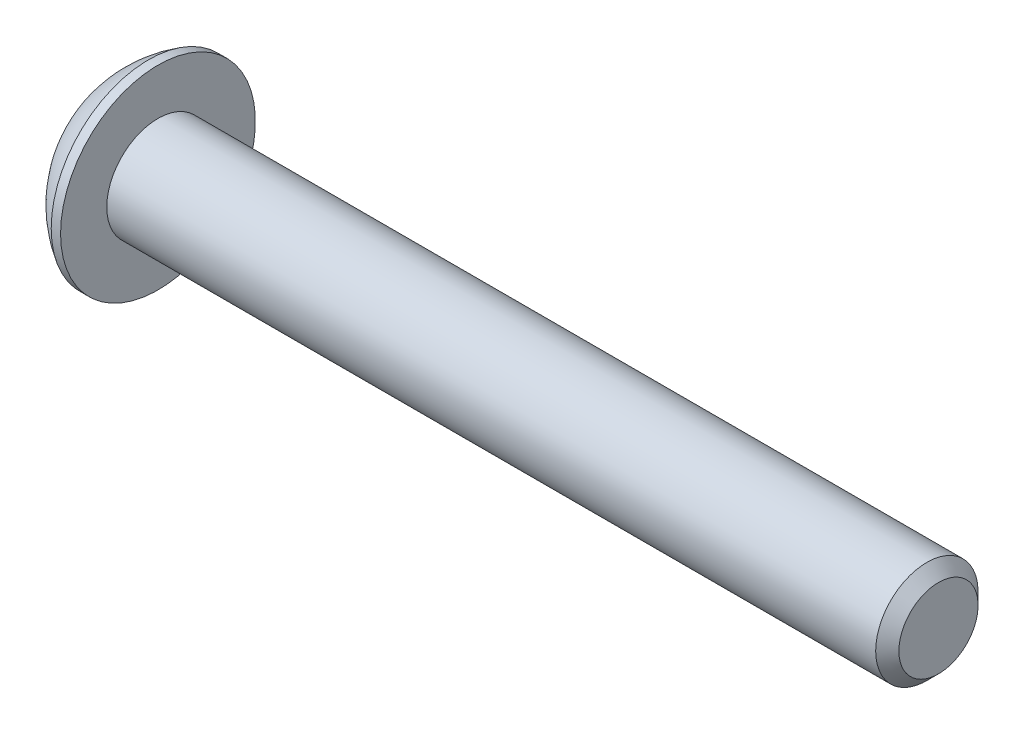
ISO-10303-21;
HEADER;
FILE_DESCRIPTION(('STEP AP214'),'2;1');
FILE_NAME('part.step','',(''),(''),'','','');
FILE_SCHEMA(('AUTOMOTIVE_DESIGN { 1 0 10303 214 1 1 1 1 }'));
ENDSEC;
DATA;
#1=APPLICATION_CONTEXT('core data for automotive mechanical design processes');
#2=APPLICATION_PROTOCOL_DEFINITION('international standard','automotive_design',2000,#1);
#3=PRODUCT_CONTEXT('',#1,'mechanical');
#4=PRODUCT('Part','Part','',(#3));
#5=PRODUCT_RELATED_PRODUCT_CATEGORY('part','',(#4));
#6=PRODUCT_DEFINITION_FORMATION('','',#4);
#7=PRODUCT_DEFINITION_CONTEXT('part definition',#1,'design');
#8=PRODUCT_DEFINITION('design','',#6,#7);
#9=PRODUCT_DEFINITION_SHAPE('','',#8);
#10=(LENGTH_UNIT() NAMED_UNIT(*) SI_UNIT(.MILLI.,.METRE.));
#11=(NAMED_UNIT(*) PLANE_ANGLE_UNIT() SI_UNIT($,.RADIAN.));
#12=(NAMED_UNIT(*) SI_UNIT($,.STERADIAN.) SOLID_ANGLE_UNIT());
#13=UNCERTAINTY_MEASURE_WITH_UNIT(LENGTH_MEASURE(1.E-05),#10,'distance_accuracy_value','');
#14=(GEOMETRIC_REPRESENTATION_CONTEXT(3) GLOBAL_UNCERTAINTY_ASSIGNED_CONTEXT((#13)) GLOBAL_UNIT_ASSIGNED_CONTEXT((#10,
#11,#12)) REPRESENTATION_CONTEXT('',''));
#15=CARTESIAN_POINT('',(0.,0.,0.));
#16=DIRECTION('',(0.,0.,1.));
#17=DIRECTION('',(1.,0.,0.));
#18=AXIS2_PLACEMENT_3D('',#15,#16,#17);
#19=CARTESIAN_POINT('',(1.32079999997359,0.,0.));
#20=DIRECTION('',(-1.,0.,0.));
#21=DIRECTION('',(0.,0.,1.));
#22=AXIS2_PLACEMENT_3D('',#19,#20,#21);
#23=CONICAL_SURFACE('',#22,1.19380000001001,1.04719755119008);
#24=CARTESIAN_POINT('',(2.0100407513155,0.,0.));
#25=VERTEX_POINT('',#24);
#26=VERTEX_LOOP('',#25);
#27=FACE_BOUND('',#26,.T.);
#28=CARTESIAN_POINT('',(1.32079999997359,0.,0.));
#29=DIRECTION('',(-1.,0.,0.));
#30=DIRECTION('',(0.,0.,1.));
#31=AXIS2_PLACEMENT_3D('',#28,#29,#30);
#32=CIRCLE('',#31,1.19380000001001);
#33=CARTESIAN_POINT('',(1.32079999998682,-1.0338611270422,0.596900000002503));
#34=VERTEX_POINT('',#33);
#35=CARTESIAN_POINT('',(1.32079999998682,0.,1.19380000000501));
#36=VERTEX_POINT('',#35);
#37=EDGE_CURVE('E92',#34,#36,#32,.T.);
#38=ORIENTED_EDGE('',*,*,#37,.T.);
#39=CARTESIAN_POINT('',(1.32079999997359,0.,0.));
#40=DIRECTION('',(-1.,0.,0.));
#41=DIRECTION('',(0.,0.,1.));
#42=AXIS2_PLACEMENT_3D('',#39,#40,#41);
#43=CIRCLE('',#42,1.19380000001001);
#44=CARTESIAN_POINT('',(1.32079999998682,1.0338611270422,0.596900000002504));
#45=VERTEX_POINT('',#44);
#46=EDGE_CURVE('E88',#36,#45,#43,.T.);
#47=ORIENTED_EDGE('',*,*,#46,.T.);
#48=CARTESIAN_POINT('',(1.32079999997359,0.,0.));
#49=DIRECTION('',(-1.,0.,0.));
#50=DIRECTION('',(0.,0.,1.));
#51=AXIS2_PLACEMENT_3D('',#48,#49,#50);
#52=CIRCLE('',#51,1.19380000001001);
#53=CARTESIAN_POINT('',(1.32079999998682,1.0338611270422,-0.596900000002504));
#54=VERTEX_POINT('',#53);
#55=EDGE_CURVE('E21',#45,#54,#52,.T.);
#56=ORIENTED_EDGE('',*,*,#55,.T.);
#57=CARTESIAN_POINT('',(1.32079999997359,0.,0.));
#58=DIRECTION('',(-1.,0.,0.));
#59=DIRECTION('',(0.,0.,1.));
#60=AXIS2_PLACEMENT_3D('',#57,#58,#59);
#61=CIRCLE('',#60,1.19380000001001);
#62=CARTESIAN_POINT('',(1.32079999998682,1.49461108489558E-12,-1.19380000000501));
#63=VERTEX_POINT('',#62);
#64=EDGE_CURVE('E151',#54,#63,#61,.T.);
#65=ORIENTED_EDGE('',*,*,#64,.T.);
#66=CARTESIAN_POINT('',(1.32079999997359,0.,0.));
#67=DIRECTION('',(-1.,0.,0.));
#68=DIRECTION('',(0.,0.,1.));
#69=AXIS2_PLACEMENT_3D('',#66,#67,#68);
#70=CIRCLE('',#69,1.19380000001001);
#71=CARTESIAN_POINT('',(1.32079999998682,-1.0338611270422,-0.596900000002503));
#72=VERTEX_POINT('',#71);
#73=EDGE_CURVE('E153',#63,#72,#70,.T.);
#74=ORIENTED_EDGE('',*,*,#73,.T.);
#75=CARTESIAN_POINT('',(1.32079999997359,0.,0.));
#76=DIRECTION('',(-1.,0.,0.));
#77=DIRECTION('',(0.,0.,1.));
#78=AXIS2_PLACEMENT_3D('',#75,#76,#77);
#79=CIRCLE('',#78,1.19380000001001);
#80=EDGE_CURVE('E155',#72,#34,#79,.T.);
#81=ORIENTED_EDGE('',*,*,#80,.T.);
#82=EDGE_LOOP('',(#38,#47,#56,#65,#74,#81));
#83=FACE_BOUND('',#82,.T.);
#84=ADVANCED_FACE('F17',(#27,#83),#23,.F.);
#85=CARTESIAN_POINT('',(1.3208,-2.06772225407572,-1.1938));
#86=DIRECTION('',(1.,0.,0.));
#87=DIRECTION('',(0.,0.,-1.));
#88=AXIS2_PLACEMENT_3D('',#85,#86,#87);
#89=PLANE('',#88);
#90=DIRECTION('',(0.,-0.5,-0.866025403784439));
#91=VECTOR('',#90,1.);
#92=CARTESIAN_POINT('',(1.32080000000004,1.37848150271715,0.));
#93=LINE('',#92,#91);
#94=CARTESIAN_POINT('',(1.32080000000001,1.37848150271715,0.));
#95=VERTEX_POINT('',#94);
#96=EDGE_CURVE('E104',#54,#95,#93,.F.);
#97=ORIENTED_EDGE('',*,*,#96,.F.);
#98=ORIENTED_EDGE('',*,*,#55,.F.);
#99=DIRECTION('',(0.,0.5,-0.866025403784439));
#100=VECTOR('',#99,1.);
#101=CARTESIAN_POINT('',(1.3208,0.689240751358576,1.1938));
#102=LINE('',#101,#100);
#103=EDGE_CURVE('E102',#95,#45,#102,.F.);
#104=ORIENTED_EDGE('',*,*,#103,.F.);
#105=EDGE_LOOP('',(#97,#98,#104));
#106=FACE_BOUND('',#105,.T.);
#107=ADVANCED_FACE('F100',(#106),#89,.F.);
#108=CARTESIAN_POINT('',(1.3208,-2.06772225407572,-1.1938));
#109=DIRECTION('',(1.,0.,0.));
#110=DIRECTION('',(0.,0.,-1.));
#111=AXIS2_PLACEMENT_3D('',#108,#109,#110);
#112=PLANE('',#111);
#113=DIRECTION('',(0.,0.5,-0.866025403784439));
#114=VECTOR('',#113,1.);
#115=CARTESIAN_POINT('',(1.32080000000004,0.689240751358576,1.1938));
#116=LINE('',#115,#114);
#117=CARTESIAN_POINT('',(1.32080000000001,0.689240751358576,1.1938));
#118=VERTEX_POINT('',#117);
#119=EDGE_CURVE('E106',#45,#118,#116,.F.);
#120=ORIENTED_EDGE('',*,*,#119,.F.);
#121=ORIENTED_EDGE('',*,*,#46,.F.);
#122=DIRECTION('',(0.,1.,0.));
#123=VECTOR('',#122,1.);
#124=CARTESIAN_POINT('',(1.3208,-0.689240751358574,1.1938));
#125=LINE('',#124,#123);
#126=EDGE_CURVE('E109',#118,#36,#125,.F.);
#127=ORIENTED_EDGE('',*,*,#126,.F.);
#128=EDGE_LOOP('',(#120,#121,#127));
#129=FACE_BOUND('',#128,.T.);
#130=ADVANCED_FACE('F107',(#129),#112,.F.);
#131=CARTESIAN_POINT('',(1.3208,-2.06772225407572,-1.1938));
#132=DIRECTION('',(1.,0.,0.));
#133=DIRECTION('',(0.,0.,-1.));
#134=AXIS2_PLACEMENT_3D('',#131,#132,#133);
#135=PLANE('',#134);
#136=DIRECTION('',(0.,1.,0.));
#137=VECTOR('',#136,1.);
#138=CARTESIAN_POINT('',(1.32080000000004,-0.689240751358574,1.1938));
#139=LINE('',#138,#137);
#140=CARTESIAN_POINT('',(1.32080000000001,-0.689240751358574,1.1938));
#141=VERTEX_POINT('',#140);
#142=EDGE_CURVE('E169',#36,#141,#139,.F.);
#143=ORIENTED_EDGE('',*,*,#142,.F.);
#144=ORIENTED_EDGE('',*,*,#37,.F.);
#145=DIRECTION('',(0.,0.5,0.866025403784439));
#146=VECTOR('',#145,1.);
#147=CARTESIAN_POINT('',(1.3208,-1.37848150271715,0.));
#148=LINE('',#147,#146);
#149=EDGE_CURVE('E167',#141,#34,#148,.F.);
#150=ORIENTED_EDGE('',*,*,#149,.F.);
#151=EDGE_LOOP('',(#143,#144,#150));
#152=FACE_BOUND('',#151,.T.);
#153=ADVANCED_FACE('F165',(#152),#135,.F.);
#154=CARTESIAN_POINT('',(1.3208,-2.06772225407572,-1.1938));
#155=DIRECTION('',(1.,0.,0.));
#156=DIRECTION('',(0.,0.,-1.));
#157=AXIS2_PLACEMENT_3D('',#154,#155,#156);
#158=PLANE('',#157);
#159=DIRECTION('',(0.,0.5,0.866025403784439));
#160=VECTOR('',#159,1.);
#161=CARTESIAN_POINT('',(1.32080000000004,-1.37848150271715,0.));
#162=LINE('',#161,#160);
#163=CARTESIAN_POINT('',(1.32080000000001,-1.37848150271715,0.));
#164=VERTEX_POINT('',#163);
#165=EDGE_CURVE('E170',#34,#164,#162,.F.);
#166=ORIENTED_EDGE('',*,*,#165,.F.);
#167=ORIENTED_EDGE('',*,*,#80,.F.);
#168=DIRECTION('',(0.,-0.5,0.866025403784439));
#169=VECTOR('',#168,1.);
#170=CARTESIAN_POINT('',(1.3208,-0.689240751358574,-1.1938));
#171=LINE('',#170,#169);
#172=EDGE_CURVE('E173',#164,#72,#171,.F.);
#173=ORIENTED_EDGE('',*,*,#172,.F.);
#174=EDGE_LOOP('',(#166,#167,#173));
#175=FACE_BOUND('',#174,.T.);
#176=ADVANCED_FACE('F171',(#175),#158,.F.);
#177=CARTESIAN_POINT('',(1.3208,-2.06772225407572,-1.1938));
#178=DIRECTION('',(1.,0.,0.));
#179=DIRECTION('',(0.,0.,-1.));
#180=AXIS2_PLACEMENT_3D('',#177,#178,#179);
#181=PLANE('',#180);
#182=DIRECTION('',(0.,-0.5,0.866025403784439));
#183=VECTOR('',#182,1.);
#184=CARTESIAN_POINT('',(1.32080000000004,-0.689240751358574,-1.1938));
#185=LINE('',#184,#183);
#186=CARTESIAN_POINT('',(1.32080000000001,-0.689240751358574,-1.1938));
#187=VERTEX_POINT('',#186);
#188=EDGE_CURVE('E228',#72,#187,#185,.F.);
#189=ORIENTED_EDGE('',*,*,#188,.F.);
#190=ORIENTED_EDGE('',*,*,#73,.F.);
#191=DIRECTION('',(0.,1.,0.));
#192=VECTOR('',#191,1.);
#193=CARTESIAN_POINT('',(1.3208,0.689240751358577,-1.1938));
#194=LINE('',#193,#192);
#195=EDGE_CURVE('E240',#187,#63,#194,.T.);
#196=ORIENTED_EDGE('',*,*,#195,.F.);
#197=EDGE_LOOP('',(#189,#190,#196));
#198=FACE_BOUND('',#197,.T.);
#199=ADVANCED_FACE('F369',(#198),#181,.F.);
#200=CARTESIAN_POINT('',(1.3208,-2.06772225407572,-1.1938));
#201=DIRECTION('',(1.,0.,0.));
#202=DIRECTION('',(0.,0.,-1.));
#203=AXIS2_PLACEMENT_3D('',#200,#201,#202);
#204=PLANE('',#203);
#205=DIRECTION('',(0.,1.,0.));
#206=VECTOR('',#205,1.);
#207=CARTESIAN_POINT('',(1.32080000000004,0.689240751358577,-1.1938));
#208=LINE('',#207,#206);
#209=CARTESIAN_POINT('',(1.32080000000002,0.689240751358565,-1.19380000000002));
#210=VERTEX_POINT('',#209);
#211=EDGE_CURVE('E248',#63,#210,#208,.T.);
#212=ORIENTED_EDGE('',*,*,#211,.F.);
#213=ORIENTED_EDGE('',*,*,#64,.F.);
#214=DIRECTION('',(0.,-0.5,-0.866025403784439));
#215=VECTOR('',#214,1.);
#216=CARTESIAN_POINT('',(1.3208,1.37848150271715,0.));
#217=LINE('',#216,#215);
#218=EDGE_CURVE('E128',#210,#54,#217,.F.);
#219=ORIENTED_EDGE('',*,*,#218,.F.);
#220=EDGE_LOOP('',(#212,#213,#219));
#221=FACE_BOUND('',#220,.T.);
#222=ADVANCED_FACE('F361',(#221),#204,.F.);
#223=CARTESIAN_POINT('',(1.3208,1.37848150271715,0.));
#224=DIRECTION('',(0.,-0.866025403784439,0.5));
#225=DIRECTION('',(0.,-0.5,-0.866025403784439));
#226=AXIS2_PLACEMENT_3D('',#223,#224,#225);
#227=PLANE('',#226);
#228=ORIENTED_EDGE('',*,*,#96,.T.);
#229=DIRECTION('',(1.,0.,0.));
#230=VECTOR('',#229,1.);
#231=CARTESIAN_POINT('',(1.3208,1.37848150271715,0.));
#232=LINE('',#231,#230);
#233=CARTESIAN_POINT('',(0.,1.37848150271715,0.));
#234=VERTEX_POINT('',#233);
#235=EDGE_CURVE('E116',#234,#95,#232,.T.);
#236=ORIENTED_EDGE('',*,*,#235,.F.);
#237=DIRECTION('',(0.,0.5,0.866025403784439));
#238=VECTOR('',#237,1.);
#239=CARTESIAN_POINT('',(0.,0.689240751358577,-1.1938));
#240=LINE('',#239,#238);
#241=CARTESIAN_POINT('',(0.,0.689240751358577,-1.1938));
#242=VERTEX_POINT('',#241);
#243=EDGE_CURVE('E131',#242,#234,#240,.T.);
#244=ORIENTED_EDGE('',*,*,#243,.F.);
#245=DIRECTION('',(1.,0.,0.));
#246=VECTOR('',#245,1.);
#247=CARTESIAN_POINT('',(1.3208,0.689240751358577,-1.1938));
#248=LINE('',#247,#246);
#249=EDGE_CURVE('E135',#210,#242,#248,.F.);
#250=ORIENTED_EDGE('',*,*,#249,.F.);
#251=ORIENTED_EDGE('',*,*,#218,.T.);
#252=EDGE_LOOP('',(#228,#236,#244,#250,#251));
#253=FACE_BOUND('',#252,.T.);
#254=ADVANCED_FACE('F354',(#253),#227,.T.);
#255=CARTESIAN_POINT('',(1.3208,0.689240751358576,1.1938));
#256=DIRECTION('',(0.,-0.866025403784439,-0.5));
#257=DIRECTION('',(0.,0.5,-0.866025403784439));
#258=AXIS2_PLACEMENT_3D('',#255,#256,#257);
#259=PLANE('',#258);
#260=ORIENTED_EDGE('',*,*,#119,.T.);
#261=DIRECTION('',(1.,0.,0.));
#262=VECTOR('',#261,1.);
#263=CARTESIAN_POINT('',(1.3208,0.689240751358576,1.1938));
#264=LINE('',#263,#262);
#265=CARTESIAN_POINT('',(0.,0.689240751358577,1.1938));
#266=VERTEX_POINT('',#265);
#267=EDGE_CURVE('E112',#266,#118,#264,.T.);
#268=ORIENTED_EDGE('',*,*,#267,.F.);
#269=DIRECTION('',(0.,-0.5,0.866025403784439));
#270=VECTOR('',#269,1.);
#271=CARTESIAN_POINT('',(0.,1.37848150271715,0.));
#272=LINE('',#271,#270);
#273=EDGE_CURVE('E134',#234,#266,#272,.T.);
#274=ORIENTED_EDGE('',*,*,#273,.F.);
#275=ORIENTED_EDGE('',*,*,#235,.T.);
#276=ORIENTED_EDGE('',*,*,#103,.T.);
#277=EDGE_LOOP('',(#260,#268,#274,#275,#276));
#278=FACE_BOUND('',#277,.T.);
#279=ADVANCED_FACE('F114',(#278),#259,.T.);
#280=CARTESIAN_POINT('',(1.3208,-0.689240751358574,1.1938));
#281=DIRECTION('',(0.,0.,-1.));
#282=DIRECTION('',(0.,1.,0.));
#283=AXIS2_PLACEMENT_3D('',#280,#281,#282);
#284=PLANE('',#283);
#285=ORIENTED_EDGE('',*,*,#142,.T.);
#286=DIRECTION('',(1.,0.,0.));
#287=VECTOR('',#286,1.);
#288=CARTESIAN_POINT('',(1.3208,-0.689240751358574,1.1938));
#289=LINE('',#288,#287);
#290=CARTESIAN_POINT('',(0.,-0.689240751358574,1.1938));
#291=VERTEX_POINT('',#290);
#292=EDGE_CURVE('E180',#291,#141,#289,.T.);
#293=ORIENTED_EDGE('',*,*,#292,.F.);
#294=DIRECTION('',(0.,1.,0.));
#295=VECTOR('',#294,1.);
#296=CARTESIAN_POINT('',(0.,0.,1.1938));
#297=LINE('',#296,#295);
#298=EDGE_CURVE('E194',#266,#291,#297,.F.);
#299=ORIENTED_EDGE('',*,*,#298,.F.);
#300=ORIENTED_EDGE('',*,*,#267,.T.);
#301=ORIENTED_EDGE('',*,*,#126,.T.);
#302=EDGE_LOOP('',(#285,#293,#299,#300,#301));
#303=FACE_BOUND('',#302,.T.);
#304=ADVANCED_FACE('F216',(#303),#284,.T.);
#305=CARTESIAN_POINT('',(1.3208,-1.37848150271715,0.));
#306=DIRECTION('',(0.,0.866025403784439,-0.5));
#307=DIRECTION('',(0.,0.5,0.866025403784439));
#308=AXIS2_PLACEMENT_3D('',#305,#306,#307);
#309=PLANE('',#308);
#310=ORIENTED_EDGE('',*,*,#165,.T.);
#311=DIRECTION('',(1.,0.,0.));
#312=VECTOR('',#311,1.);
#313=CARTESIAN_POINT('',(1.3208,-1.37848150271715,0.));
#314=LINE('',#313,#312);
#315=CARTESIAN_POINT('',(0.,-1.37848150271715,0.));
#316=VERTEX_POINT('',#315);
#317=EDGE_CURVE('E176',#316,#164,#314,.T.);
#318=ORIENTED_EDGE('',*,*,#317,.F.);
#319=DIRECTION('',(0.,-0.5,-0.866025403784439));
#320=VECTOR('',#319,1.);
#321=CARTESIAN_POINT('',(0.,-0.689240751358574,1.1938));
#322=LINE('',#321,#320);
#323=EDGE_CURVE('E197',#291,#316,#322,.T.);
#324=ORIENTED_EDGE('',*,*,#323,.F.);
#325=ORIENTED_EDGE('',*,*,#292,.T.);
#326=ORIENTED_EDGE('',*,*,#149,.T.);
#327=EDGE_LOOP('',(#310,#318,#324,#325,#326));
#328=FACE_BOUND('',#327,.T.);
#329=ADVANCED_FACE('F178',(#328),#309,.T.);
#330=CARTESIAN_POINT('',(1.3208,-0.689240751358574,-1.1938));
#331=DIRECTION('',(0.,0.866025403784439,0.5));
#332=DIRECTION('',(0.,-0.5,0.866025403784439));
#333=AXIS2_PLACEMENT_3D('',#330,#331,#332);
#334=PLANE('',#333);
#335=ORIENTED_EDGE('',*,*,#188,.T.);
#336=DIRECTION('',(1.,0.,0.));
#337=VECTOR('',#336,1.);
#338=CARTESIAN_POINT('',(1.3208,-0.689240751358574,-1.1938));
#339=LINE('',#338,#337);
#340=CARTESIAN_POINT('',(0.,-0.689240751358574,-1.1938));
#341=VERTEX_POINT('',#340);
#342=EDGE_CURVE('E36',#341,#187,#339,.T.);
#343=ORIENTED_EDGE('',*,*,#342,.F.);
#344=DIRECTION('',(0.,0.5,-0.866025403784439));
#345=VECTOR('',#344,1.);
#346=CARTESIAN_POINT('',(0.,-1.37848150271715,0.));
#347=LINE('',#346,#345);
#348=EDGE_CURVE('E217',#316,#341,#347,.T.);
#349=ORIENTED_EDGE('',*,*,#348,.F.);
#350=ORIENTED_EDGE('',*,*,#317,.T.);
#351=ORIENTED_EDGE('',*,*,#172,.T.);
#352=EDGE_LOOP('',(#335,#343,#349,#350,#351));
#353=FACE_BOUND('',#352,.T.);
#354=ADVANCED_FACE('F328',(#353),#334,.T.);
#355=CARTESIAN_POINT('',(1.3208,0.689240751358577,-1.1938));
#356=DIRECTION('',(0.,0.,1.));
#357=DIRECTION('',(1.,0.,0.));
#358=AXIS2_PLACEMENT_3D('',#355,#356,#357);
#359=PLANE('',#358);
#360=ORIENTED_EDGE('',*,*,#211,.T.);
#361=ORIENTED_EDGE('',*,*,#249,.T.);
#362=DIRECTION('',(0.,1.,0.));
#363=VECTOR('',#362,1.);
#364=CARTESIAN_POINT('',(0.,0.,-1.1938));
#365=LINE('',#364,#363);
#366=EDGE_CURVE('E150',#341,#242,#365,.T.);
#367=ORIENTED_EDGE('',*,*,#366,.F.);
#368=ORIENTED_EDGE('',*,*,#342,.T.);
#369=ORIENTED_EDGE('',*,*,#195,.T.);
#370=EDGE_LOOP('',(#360,#361,#367,#368,#369));
#371=FACE_BOUND('',#370,.T.);
#372=ADVANCED_FACE('F321',(#371),#359,.T.);
#373=CARTESIAN_POINT('',(0.,0.,0.));
#374=DIRECTION('',(-1.,0.,0.));
#375=DIRECTION('',(0.,0.,1.));
#376=AXIS2_PLACEMENT_3D('',#373,#374,#375);
#377=PLANE('',#376);
#378=CARTESIAN_POINT('',(0.,0.,0.));
#379=DIRECTION('',(-1.,0.,0.));
#380=DIRECTION('',(0.,0.,1.));
#381=AXIS2_PLACEMENT_3D('',#378,#379,#380);
#382=CIRCLE('',#381,1.9812);
#383=CARTESIAN_POINT('',(0.,0.,1.9812));
#384=VERTEX_POINT('',#383);
#385=EDGE_CURVE('E147',#384,#384,#382,.F.);
#386=ORIENTED_EDGE('',*,*,#385,.F.);
#387=EDGE_LOOP('',(#386));
#388=FACE_BOUND('',#387,.T.);
#389=ORIENTED_EDGE('',*,*,#348,.T.);
#390=ORIENTED_EDGE('',*,*,#366,.T.);
#391=ORIENTED_EDGE('',*,*,#243,.T.);
#392=ORIENTED_EDGE('',*,*,#273,.T.);
#393=ORIENTED_EDGE('',*,*,#298,.T.);
#394=ORIENTED_EDGE('',*,*,#323,.T.);
#395=EDGE_LOOP('',(#389,#390,#391,#392,#393,#394));
#396=FACE_BOUND('',#395,.T.);
#397=ADVANCED_FACE('F210',(#388,#396),#377,.T.);
#398=CARTESIAN_POINT('',(4.13385,0.,0.));
#399=DIRECTION('',(0.,1.,0.));
#400=DIRECTION('',(-0.489667403954941,0.,-0.87190930348519));
#401=AXIS2_PLACEMENT_3D('',#398,#399,#400);
#402=SPHERICAL_SURFACE('',#401,4.58408870578439);
#403=CARTESIAN_POINT('',(4.13385,0.,0.));
#404=DIRECTION('',(-1.,0.,0.));
#405=DIRECTION('',(0.,0.,1.));
#406=AXIS2_PLACEMENT_3D('',#403,#404,#405);
#407=SPHERICAL_SURFACE('',#406,4.58408870578439);
#408=ORIENTED_EDGE('',*,*,#385,.T.);
#409=EDGE_LOOP('',(#408));
#410=FACE_BOUND('',#409,.T.);
#411=CARTESIAN_POINT('',(1.8288,0.,0.));
#412=DIRECTION('',(-1.,0.,0.));
#413=DIRECTION('',(0.,0.,1.));
#414=AXIS2_PLACEMENT_3D('',#411,#412,#413);
#415=CIRCLE('',#414,3.9624);
#416=CARTESIAN_POINT('',(1.8288,0.,3.9624));
#417=VERTEX_POINT('',#416);
#418=EDGE_CURVE('E144',#417,#417,#415,.F.);
#419=ORIENTED_EDGE('',*,*,#418,.F.);
#420=EDGE_LOOP('',(#419));
#421=FACE_BOUND('',#420,.T.);
#422=ADVANCED_FACE('F19',(#410,#421),#407,.T.);
#423=CARTESIAN_POINT('',(33.9598,0.,0.));
#424=DIRECTION('',(-1.,0.,0.));
#425=DIRECTION('',(0.,0.,1.));
#426=AXIS2_PLACEMENT_3D('',#423,#424,#425);
#427=PLANE('',#426);
#428=CARTESIAN_POINT('',(33.959799999991,0.,0.));
#429=DIRECTION('',(-1.,0.,0.));
#430=DIRECTION('',(0.,0.,1.));
#431=AXIS2_PLACEMENT_3D('',#428,#429,#430);
#432=CIRCLE('',#431,1.61035999997239);
#433=CARTESIAN_POINT('',(33.959799999991,0.,1.61035999997239));
#434=VERTEX_POINT('',#433);
#435=EDGE_CURVE('E141',#434,#434,#432,.T.);
#436=ORIENTED_EDGE('',*,*,#435,.F.);
#437=EDGE_LOOP('',(#436));
#438=FACE_BOUND('',#437,.T.);
#439=ADVANCED_FACE('F270',(#438),#427,.F.);
#440=CARTESIAN_POINT('',(0.,0.,0.));
#441=DIRECTION('',(-1.,0.,0.));
#442=DIRECTION('',(0.,0.,1.));
#443=AXIS2_PLACEMENT_3D('',#440,#441,#442);
#444=CYLINDRICAL_SURFACE('',#443,3.9624);
#445=ORIENTED_EDGE('',*,*,#418,.T.);
#446=EDGE_LOOP('',(#445));
#447=FACE_BOUND('',#446,.T.);
#448=CARTESIAN_POINT('',(2.2098,0.,0.));
#449=DIRECTION('',(-1.,0.,0.));
#450=DIRECTION('',(0.,0.,1.));
#451=AXIS2_PLACEMENT_3D('',#448,#449,#450);
#452=CIRCLE('',#451,3.9624);
#453=CARTESIAN_POINT('',(2.2098,0.,3.9624));
#454=VERTEX_POINT('',#453);
#455=EDGE_CURVE('E138',#454,#454,#452,.T.);
#456=ORIENTED_EDGE('',*,*,#455,.T.);
#457=EDGE_LOOP('',(#456));
#458=FACE_BOUND('',#457,.T.);
#459=ADVANCED_FACE('F266',(#447,#458),#444,.T.);
#460=CARTESIAN_POINT('',(33.4873600000947,0.,0.));
#461=DIRECTION('',(-1.,0.,0.));
#462=DIRECTION('',(0.,0.,1.));
#463=AXIS2_PLACEMENT_3D('',#460,#461,#462);
#464=CONICAL_SURFACE('',#463,2.08279999986871,0.785398163397448);
#465=CARTESIAN_POINT('',(33.48736,0.,0.));
#466=DIRECTION('',(-1.,0.,0.));
#467=DIRECTION('',(0.,0.,1.));
#468=AXIS2_PLACEMENT_3D('',#465,#466,#467);
#469=CIRCLE('',#468,2.0828);
#470=CARTESIAN_POINT('',(33.48736,0.,2.0828));
#471=VERTEX_POINT('',#470);
#472=EDGE_CURVE('E27',#471,#471,#469,.T.);
#473=ORIENTED_EDGE('',*,*,#472,.F.);
#474=EDGE_LOOP('',(#473));
#475=FACE_BOUND('',#474,.T.);
#476=ORIENTED_EDGE('',*,*,#435,.T.);
#477=EDGE_LOOP('',(#476));
#478=FACE_BOUND('',#477,.T.);
#479=ADVANCED_FACE('F262',(#475,#478),#464,.T.);
#480=CARTESIAN_POINT('',(2.2098,2.0828,0.));
#481=DIRECTION('',(-1.,0.,0.));
#482=DIRECTION('',(0.,0.,1.));
#483=AXIS2_PLACEMENT_3D('',#480,#481,#482);
#484=PLANE('',#483);
#485=ORIENTED_EDGE('',*,*,#455,.F.);
#486=EDGE_LOOP('',(#485));
#487=FACE_BOUND('',#486,.T.);
#488=CARTESIAN_POINT('',(2.2098,0.,0.));
#489=DIRECTION('',(-1.,0.,0.));
#490=DIRECTION('',(0.,0.,1.));
#491=AXIS2_PLACEMENT_3D('',#488,#489,#490);
#492=CIRCLE('',#491,2.0828);
#493=CARTESIAN_POINT('',(2.2098,0.,2.0828));
#494=VERTEX_POINT('',#493);
#495=EDGE_CURVE('E11',#494,#494,#492,.F.);
#496=ORIENTED_EDGE('',*,*,#495,.F.);
#497=EDGE_LOOP('',(#496));
#498=FACE_BOUND('',#497,.T.);
#499=ADVANCED_FACE('F265',(#487,#498),#484,.F.);
#500=CARTESIAN_POINT('',(0.,0.,0.));
#501=DIRECTION('',(-1.,0.,0.));
#502=DIRECTION('',(0.,0.,1.));
#503=AXIS2_PLACEMENT_3D('',#500,#501,#502);
#504=CYLINDRICAL_SURFACE('',#503,2.0828);
#505=ORIENTED_EDGE('',*,*,#495,.T.);
#506=EDGE_LOOP('',(#505));
#507=FACE_BOUND('',#506,.T.);
#508=ORIENTED_EDGE('',*,*,#472,.T.);
#509=EDGE_LOOP('',(#508));
#510=FACE_BOUND('',#509,.T.);
#511=ADVANCED_FACE('F260',(#507,#510),#504,.T.);
#512=CLOSED_SHELL('',(#84,#107,#130,#153,#176,#199,#222,#254,#279,#304,#329,#354,#372,#397,#422,
#439,#459,#479,#499,#511));
#513=MANIFOLD_SOLID_BREP('B1',#512);
#514=ADVANCED_BREP_SHAPE_REPRESENTATION('',(#18,#513),#14);
#515=SHAPE_DEFINITION_REPRESENTATION(#9,#514);
ENDSEC;
END-ISO-10303-21;
